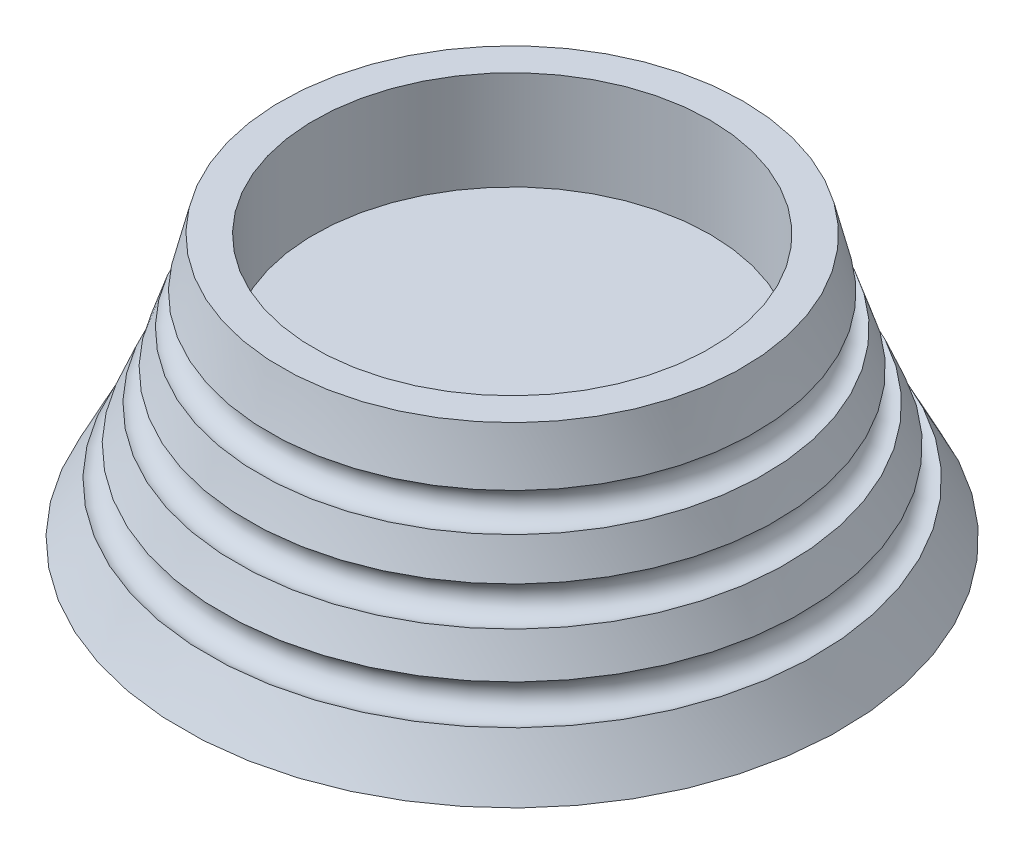
ISO-10303-21;
HEADER;
FILE_DESCRIPTION(('STEP AP214'),'2;1');
FILE_NAME('part.step','',(''),(''),'','','');
FILE_SCHEMA(('AUTOMOTIVE_DESIGN { 1 0 10303 214 1 1 1 1 }'));
ENDSEC;
DATA;
#1=APPLICATION_CONTEXT('core data for automotive mechanical design processes');
#2=APPLICATION_PROTOCOL_DEFINITION('international standard','automotive_design',2000,#1);
#3=PRODUCT_CONTEXT('',#1,'mechanical');
#4=PRODUCT('Part','Part','',(#3));
#5=PRODUCT_RELATED_PRODUCT_CATEGORY('part','',(#4));
#6=PRODUCT_DEFINITION_FORMATION('','',#4);
#7=PRODUCT_DEFINITION_CONTEXT('part definition',#1,'design');
#8=PRODUCT_DEFINITION('design','',#6,#7);
#9=PRODUCT_DEFINITION_SHAPE('','',#8);
#10=(LENGTH_UNIT() NAMED_UNIT(*) SI_UNIT(.MILLI.,.METRE.));
#11=(NAMED_UNIT(*) PLANE_ANGLE_UNIT() SI_UNIT($,.RADIAN.));
#12=(NAMED_UNIT(*) SI_UNIT($,.STERADIAN.) SOLID_ANGLE_UNIT());
#13=UNCERTAINTY_MEASURE_WITH_UNIT(LENGTH_MEASURE(1.E-05),#10,'distance_accuracy_value','');
#14=(GEOMETRIC_REPRESENTATION_CONTEXT(3) GLOBAL_UNCERTAINTY_ASSIGNED_CONTEXT((#13)) GLOBAL_UNIT_ASSIGNED_CONTEXT((#10,
#11,#12)) REPRESENTATION_CONTEXT('',''));
#15=CARTESIAN_POINT('',(0.,0.,0.));
#16=DIRECTION('',(0.,0.,1.));
#17=DIRECTION('',(1.,0.,0.));
#18=AXIS2_PLACEMENT_3D('',#15,#16,#17);
#19=CARTESIAN_POINT('',(0.,0.,0.));
#20=DIRECTION('',(0.,-1.,0.));
#21=DIRECTION('',(0.,0.,-1.));
#22=AXIS2_PLACEMENT_3D('',#19,#20,#21);
#23=PLANE('',#22);
#24=CARTESIAN_POINT('',(0.,0.,0.));
#25=DIRECTION('',(0.,-1.,0.));
#26=DIRECTION('',(0.,0.,-1.));
#27=AXIS2_PLACEMENT_3D('',#24,#25,#26);
#28=CIRCLE('',#27,50.);
#29=CARTESIAN_POINT('',(0.,0.,-50.));
#30=VERTEX_POINT('',#29);
#31=EDGE_CURVE('E10',#30,#30,#28,.T.);
#32=ORIENTED_EDGE('',*,*,#31,.T.);
#33=EDGE_LOOP('',(#32));
#34=FACE_BOUND('',#33,.T.);
#35=ADVANCED_FACE('F31',(#34),#23,.T.);
#36=CARTESIAN_POINT('',(0.,72.131781119963,0.));
#37=DIRECTION('',(0.,-1.,0.));
#38=DIRECTION('',(0.,0.,-1.));
#39=AXIS2_PLACEMENT_3D('',#36,#37,#38);
#40=TOROIDAL_SURFACE('',#39,181.518082986568,150.);
#41=CARTESIAN_POINT('',(0.,7.73325720058086,0.));
#42=DIRECTION('',(0.,-1.,0.));
#43=DIRECTION('',(0.,0.,-1.));
#44=AXIS2_PLACEMENT_3D('',#41,#42,#43);
#45=CIRCLE('',#44,46.0454653953928);
#46=CARTESIAN_POINT('',(0.,7.73325720058086,-46.0454653953928));
#47=VERTEX_POINT('',#46);
#48=EDGE_CURVE('E37',#47,#47,#45,.T.);
#49=ORIENTED_EDGE('',*,*,#48,.T.);
#50=EDGE_LOOP('',(#49));
#51=FACE_BOUND('',#50,.T.);
#52=ORIENTED_EDGE('',*,*,#31,.F.);
#53=EDGE_LOOP('',(#52));
#54=FACE_BOUND('',#53,.T.);
#55=ADVANCED_FACE('F81',(#51,#54),#40,.F.);
#56=CARTESIAN_POINT('',(0.,9.99999999999999,0.));
#57=DIRECTION('',(0.,-1.,0.));
#58=DIRECTION('',(0.,0.,-1.));
#59=AXIS2_PLACEMENT_3D('',#56,#57,#58);
#60=TOROIDAL_SURFACE('',#59,44.9910095730467,2.49999999999962);
#61=CARTESIAN_POINT('',(0.,12.284001627508,0.));
#62=DIRECTION('',(0.,-1.,0.));
#63=DIRECTION('',(0.,0.,-1.));
#64=AXIS2_PLACEMENT_3D('',#61,#62,#63);
#65=CIRCLE('',#64,43.9744779377598);
#66=CARTESIAN_POINT('',(0.,12.284001627508,-43.9744779377598));
#67=VERTEX_POINT('',#66);
#68=EDGE_CURVE('E41',#67,#67,#65,.T.);
#69=ORIENTED_EDGE('',*,*,#68,.T.);
#70=EDGE_LOOP('',(#69));
#71=FACE_BOUND('',#70,.T.);
#72=ORIENTED_EDGE('',*,*,#48,.F.);
#73=EDGE_LOOP('',(#72));
#74=FACE_BOUND('',#73,.T.);
#75=ADVANCED_FACE('F85',(#71,#74),#60,.F.);
#76=CARTESIAN_POINT('',(0.,72.131781119963,0.));
#77=DIRECTION('',(0.,-1.,0.));
#78=DIRECTION('',(0.,0.,-1.));
#79=AXIS2_PLACEMENT_3D('',#76,#77,#78);
#80=TOROIDAL_SURFACE('',#79,181.518082986568,150.);
#81=CARTESIAN_POINT('',(0.,17.663163851448,0.));
#82=DIRECTION('',(0.,-1.,0.));
#83=DIRECTION('',(0.,0.,-1.));
#84=AXIS2_PLACEMENT_3D('',#81,#82,#83);
#85=CIRCLE('',#84,41.7569663165296);
#86=CARTESIAN_POINT('',(0.,17.663163851448,-41.7569663165296));
#87=VERTEX_POINT('',#86);
#88=EDGE_CURVE('E45',#87,#87,#85,.T.);
#89=ORIENTED_EDGE('',*,*,#88,.T.);
#90=EDGE_LOOP('',(#89));
#91=FACE_BOUND('',#90,.T.);
#92=ORIENTED_EDGE('',*,*,#68,.F.);
#93=EDGE_LOOP('',(#92));
#94=FACE_BOUND('',#93,.T.);
#95=ADVANCED_FACE('F89',(#91,#94),#80,.F.);
#96=CARTESIAN_POINT('',(0.,20.,0.));
#97=DIRECTION('',(0.,-1.,0.));
#98=DIRECTION('',(0.,0.,-1.));
#99=AXIS2_PLACEMENT_3D('',#96,#97,#98);
#100=TOROIDAL_SURFACE('',#99,40.8685988166632,2.49999999999962);
#101=CARTESIAN_POINT('',(0.,22.3513171988631,0.));
#102=DIRECTION('',(0.,-1.,0.));
#103=DIRECTION('',(0.,0.,-1.));
#104=AXIS2_PLACEMENT_3D('',#101,#102,#103);
#105=CIRCLE('',#104,40.019300617955);
#106=CARTESIAN_POINT('',(0.,22.3513171988631,-40.019300617955));
#107=VERTEX_POINT('',#106);
#108=EDGE_CURVE('E50',#107,#107,#105,.T.);
#109=ORIENTED_EDGE('',*,*,#108,.T.);
#110=EDGE_LOOP('',(#109));
#111=FACE_BOUND('',#110,.T.);
#112=ORIENTED_EDGE('',*,*,#88,.F.);
#113=EDGE_LOOP('',(#112));
#114=FACE_BOUND('',#113,.T.);
#115=ADVANCED_FACE('F96',(#111,#114),#100,.F.);
#116=CARTESIAN_POINT('',(0.,72.131781119963,0.));
#117=DIRECTION('',(0.,-1.,0.));
#118=DIRECTION('',(0.,0.,-1.));
#119=AXIS2_PLACEMENT_3D('',#116,#117,#118);
#120=TOROIDAL_SURFACE('',#119,181.518082986568,150.);
#121=CARTESIAN_POINT('',(0.,27.6065766422098,0.));
#122=DIRECTION('',(0.,-1.,0.));
#123=DIRECTION('',(0.,0.,-1.));
#124=AXIS2_PLACEMENT_3D('',#121,#122,#123);
#125=CIRCLE('',#124,38.2787512155272);
#126=CARTESIAN_POINT('',(0.,27.6065766422098,-38.2787512155272));
#127=VERTEX_POINT('',#126);
#128=EDGE_CURVE('E53',#127,#127,#125,.T.);
#129=ORIENTED_EDGE('',*,*,#128,.T.);
#130=EDGE_LOOP('',(#129));
#131=FACE_BOUND('',#130,.T.);
#132=ORIENTED_EDGE('',*,*,#108,.F.);
#133=EDGE_LOOP('',(#132));
#134=FACE_BOUND('',#133,.T.);
#135=ADVANCED_FACE('F100',(#131,#134),#120,.F.);
#136=CARTESIAN_POINT('',(0.,30.,0.));
#137=DIRECTION('',(0.,-1.,0.));
#138=DIRECTION('',(0.,0.,-1.));
#139=AXIS2_PLACEMENT_3D('',#136,#137,#138);
#140=TOROIDAL_SURFACE('',#139,37.5565845932144,2.49999999999962);
#141=CARTESIAN_POINT('',(0.,32.4051266303235,0.));
#142=DIRECTION('',(0.,-1.,0.));
#143=DIRECTION('',(0.,0.,-1.));
#144=AXIS2_PLACEMENT_3D('',#141,#142,#143);
#145=CIRCLE('',#144,36.8744072760108);
#146=CARTESIAN_POINT('',(0.,32.4051266303235,-36.8744072760108));
#147=VERTEX_POINT('',#146);
#148=EDGE_CURVE('E56',#147,#147,#145,.T.);
#149=ORIENTED_EDGE('',*,*,#148,.T.);
#150=EDGE_LOOP('',(#149));
#151=FACE_BOUND('',#150,.T.);
#152=ORIENTED_EDGE('',*,*,#128,.F.);
#153=EDGE_LOOP('',(#152));
#154=FACE_BOUND('',#153,.T.);
#155=ADVANCED_FACE('F104',(#151,#154),#140,.F.);
#156=CARTESIAN_POINT('',(0.,72.131781119963,0.));
#157=DIRECTION('',(0.,-1.,0.));
#158=DIRECTION('',(0.,0.,-1.));
#159=AXIS2_PLACEMENT_3D('',#156,#157,#158);
#160=TOROIDAL_SURFACE('',#159,181.518082986568,150.);
#161=CARTESIAN_POINT('',(0.,40.,0.));
#162=DIRECTION('',(0.,-1.,0.));
#163=DIRECTION('',(0.,0.,-1.));
#164=AXIS2_PLACEMENT_3D('',#161,#162,#163);
#165=CIRCLE('',#164,35.);
#166=CARTESIAN_POINT('',(0.,40.,-35.));
#167=VERTEX_POINT('',#166);
#168=EDGE_CURVE('E59',#167,#167,#165,.T.);
#169=ORIENTED_EDGE('',*,*,#168,.T.);
#170=EDGE_LOOP('',(#169));
#171=FACE_BOUND('',#170,.T.);
#172=ORIENTED_EDGE('',*,*,#148,.F.);
#173=EDGE_LOOP('',(#172));
#174=FACE_BOUND('',#173,.T.);
#175=ADVANCED_FACE('F108',(#171,#174),#160,.F.);
#176=CARTESIAN_POINT('',(30.,40.,0.));
#177=DIRECTION('',(0.,1.,0.));
#178=DIRECTION('',(0.,0.,1.));
#179=AXIS2_PLACEMENT_3D('',#176,#177,#178);
#180=PLANE('',#179);
#181=CARTESIAN_POINT('',(0.,40.,0.));
#182=DIRECTION('',(0.,-1.,0.));
#183=DIRECTION('',(0.,0.,-1.));
#184=AXIS2_PLACEMENT_3D('',#181,#182,#183);
#185=CIRCLE('',#184,30.);
#186=CARTESIAN_POINT('',(0.,40.,-30.));
#187=VERTEX_POINT('',#186);
#188=EDGE_CURVE('E62',#187,#187,#185,.T.);
#189=ORIENTED_EDGE('',*,*,#188,.T.);
#190=EDGE_LOOP('',(#189));
#191=FACE_BOUND('',#190,.T.);
#192=ORIENTED_EDGE('',*,*,#168,.F.);
#193=EDGE_LOOP('',(#192));
#194=FACE_BOUND('',#193,.T.);
#195=ADVANCED_FACE('F78',(#191,#194),#180,.T.);
#196=CARTESIAN_POINT('',(0.,0.,0.));
#197=DIRECTION('',(0.,-1.,0.));
#198=DIRECTION('',(0.,0.,-1.));
#199=AXIS2_PLACEMENT_3D('',#196,#197,#198);
#200=CYLINDRICAL_SURFACE('',#199,30.);
#201=CARTESIAN_POINT('',(0.,25.,0.));
#202=DIRECTION('',(0.,-1.,0.));
#203=DIRECTION('',(0.,0.,-1.));
#204=AXIS2_PLACEMENT_3D('',#201,#202,#203);
#205=CIRCLE('',#204,30.);
#206=CARTESIAN_POINT('',(0.,25.,-30.));
#207=VERTEX_POINT('',#206);
#208=EDGE_CURVE('E65',#207,#207,#205,.T.);
#209=ORIENTED_EDGE('',*,*,#208,.T.);
#210=EDGE_LOOP('',(#209));
#211=FACE_BOUND('',#210,.T.);
#212=ORIENTED_EDGE('',*,*,#188,.F.);
#213=EDGE_LOOP('',(#212));
#214=FACE_BOUND('',#213,.T.);
#215=ADVANCED_FACE('F69',(#211,#214),#200,.F.);
#216=CARTESIAN_POINT('',(0.,25.,0.));
#217=DIRECTION('',(0.,1.,0.));
#218=DIRECTION('',(0.,0.,1.));
#219=AXIS2_PLACEMENT_3D('',#216,#217,#218);
#220=PLANE('',#219);
#221=ORIENTED_EDGE('',*,*,#208,.F.);
#222=EDGE_LOOP('',(#221));
#223=FACE_BOUND('',#222,.T.);
#224=ADVANCED_FACE('F72',(#223),#220,.T.);
#225=CLOSED_SHELL('',(#35,#55,#75,#95,#115,#135,#155,#175,#195,#215,#224));
#226=MANIFOLD_SOLID_BREP('B2',#225);
#227=ADVANCED_BREP_SHAPE_REPRESENTATION('',(#18,#226),#14);
#228=SHAPE_DEFINITION_REPRESENTATION(#9,#227);
ENDSEC;
END-ISO-10303-21;
